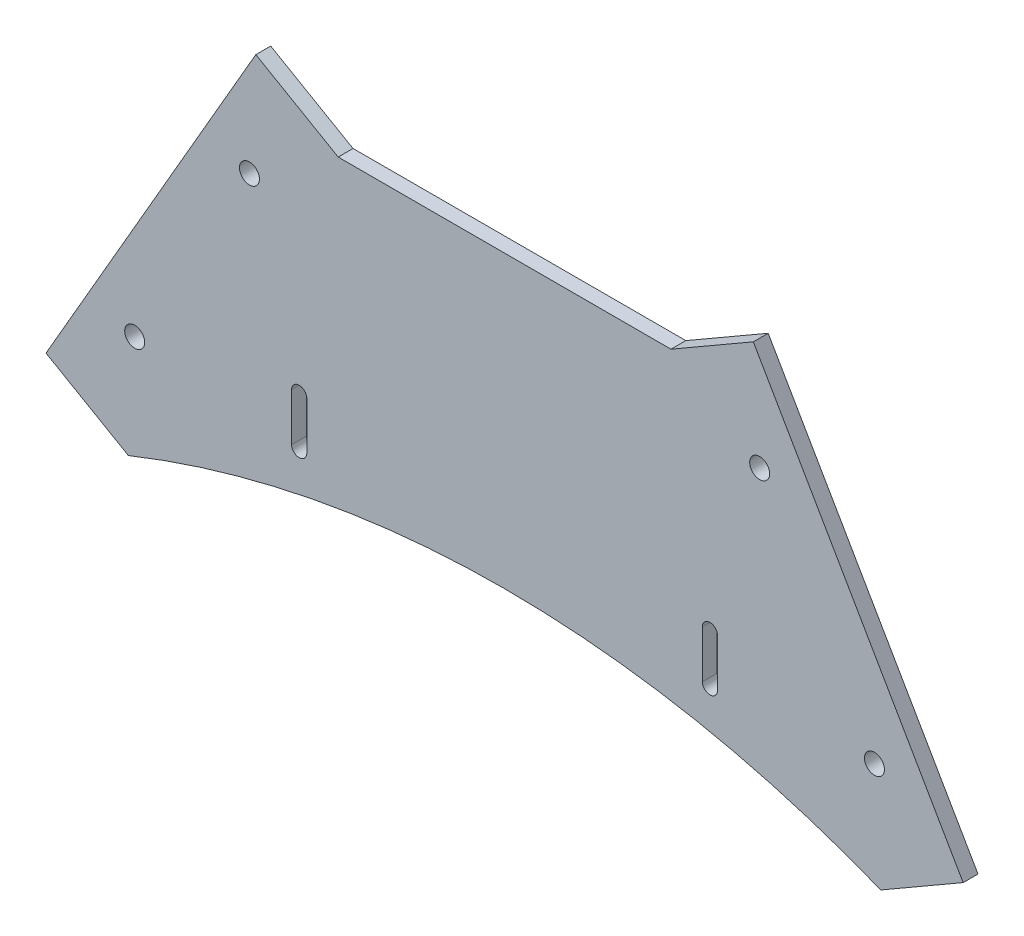
ISO-10303-21;
HEADER;
FILE_DESCRIPTION(('STEP AP214'),'2;1');
FILE_NAME('part.step','',(''),(''),'','','');
FILE_SCHEMA(('AUTOMOTIVE_DESIGN { 1 0 10303 214 1 1 1 1 }'));
ENDSEC;
DATA;
#1=APPLICATION_CONTEXT('core data for automotive mechanical design processes');
#2=APPLICATION_PROTOCOL_DEFINITION('international standard','automotive_design',2000,#1);
#3=PRODUCT_CONTEXT('',#1,'mechanical');
#4=PRODUCT('Part','Part','',(#3));
#5=PRODUCT_RELATED_PRODUCT_CATEGORY('part','',(#4));
#6=PRODUCT_DEFINITION_FORMATION('','',#4);
#7=PRODUCT_DEFINITION_CONTEXT('part definition',#1,'design');
#8=PRODUCT_DEFINITION('design','',#6,#7);
#9=PRODUCT_DEFINITION_SHAPE('','',#8);
#10=(LENGTH_UNIT() NAMED_UNIT(*) SI_UNIT(.MILLI.,.METRE.));
#11=(NAMED_UNIT(*) PLANE_ANGLE_UNIT() SI_UNIT($,.RADIAN.));
#12=(NAMED_UNIT(*) SI_UNIT($,.STERADIAN.) SOLID_ANGLE_UNIT());
#13=UNCERTAINTY_MEASURE_WITH_UNIT(LENGTH_MEASURE(1.E-05),#10,'distance_accuracy_value','');
#14=(GEOMETRIC_REPRESENTATION_CONTEXT(3) GLOBAL_UNCERTAINTY_ASSIGNED_CONTEXT((#13)) GLOBAL_UNIT_ASSIGNED_CONTEXT((#10,
#11,#12)) REPRESENTATION_CONTEXT('',''));
#15=CARTESIAN_POINT('',(0.,0.,0.));
#16=DIRECTION('',(0.,0.,1.));
#17=DIRECTION('',(1.,0.,0.));
#18=AXIS2_PLACEMENT_3D('',#15,#16,#17);
#19=CARTESIAN_POINT('',(96.4557505594944,-196.799575907765,3.125));
#20=DIRECTION('',(0.,0.,1.));
#21=DIRECTION('',(1.,0.,0.));
#22=AXIS2_PLACEMENT_3D('',#19,#20,#21);
#23=PLANE('',#22);
#24=CARTESIAN_POINT('',(150.116004597338,64.1239743106391,3.125));
#25=DIRECTION('',(0.,0.,1.));
#26=DIRECTION('',(1.,0.,0.));
#27=AXIS2_PLACEMENT_3D('',#24,#25,#26);
#28=CIRCLE('',#27,2.09999999999999);
#29=CARTESIAN_POINT('',(152.216004597338,64.1239743106391,3.125));
#30=VERTEX_POINT('',#29);
#31=EDGE_CURVE('E400',#30,#30,#28,.T.);
#32=ORIENTED_EDGE('',*,*,#31,.F.);
#33=EDGE_LOOP('',(#32));
#34=FACE_BOUND('',#33,.T.);
#35=CARTESIAN_POINT('',(42.7954965216511,64.1239743106392,3.125));
#36=DIRECTION('',(0.,0.,1.));
#37=DIRECTION('',(1.,0.,0.));
#38=AXIS2_PLACEMENT_3D('',#35,#36,#37);
#39=CIRCLE('',#38,2.10000000000002);
#40=CARTESIAN_POINT('',(44.8954965216512,64.1239743106392,3.125));
#41=VERTEX_POINT('',#40);
#42=EDGE_CURVE('E174',#41,#41,#39,.T.);
#43=ORIENTED_EDGE('',*,*,#42,.F.);
#44=EDGE_LOOP('',(#43));
#45=FACE_BOUND('',#44,.T.);
#46=CARTESIAN_POINT('',(96.4557505594944,-196.799575907765,3.125));
#47=DIRECTION('',(0.,0.,-1.));
#48=DIRECTION('',(1.,0.,0.));
#49=AXIS2_PLACEMENT_3D('',#46,#47,#48);
#50=CIRCLE('',#49,212.114260907765);
#51=CARTESIAN_POINT('',(17.3205080756887,1.6826817716975E-12,3.125));
#52=VERTEX_POINT('',#51);
#53=CARTESIAN_POINT('',(175.590993043302,1.9550500436325E-12,3.125));
#54=VERTEX_POINT('',#53);
#55=EDGE_CURVE('E215',#52,#54,#50,.T.);
#56=ORIENTED_EDGE('',*,*,#55,.T.);
#57=DIRECTION('',(0.866025403784439,0.499999999999999,0.));
#58=VECTOR('',#57,1.);
#59=CARTESIAN_POINT('',(175.590993043302,1.9550500436325E-12,3.125));
#60=LINE('',#59,#58);
#61=CARTESIAN_POINT('',(192.91150111899,10.0000000000016,3.125));
#62=VERTEX_POINT('',#61);
#63=EDGE_CURVE('E218',#54,#62,#60,.T.);
#64=ORIENTED_EDGE('',*,*,#63,.T.);
#65=DIRECTION('',(-0.499999999999998,0.86602540378444,0.));
#66=VECTOR('',#65,1.);
#67=CARTESIAN_POINT('',(148.776258635184,86.4444823863268,3.125));
#68=LINE('',#67,#66);
#69=CARTESIAN_POINT('',(148.776258635184,86.4444823863268,3.125));
#70=VERTEX_POINT('',#69);
#71=EDGE_CURVE('E221',#62,#70,#68,.T.);
#72=ORIENTED_EDGE('',*,*,#71,.T.);
#73=DIRECTION('',(-0.86602540378444,-0.499999999999997,0.));
#74=VECTOR('',#73,1.);
#75=CARTESIAN_POINT('',(131.455750559495,76.4444823863269,3.125));
#76=LINE('',#75,#74);
#77=CARTESIAN_POINT('',(131.455750559495,76.4444823863269,3.125));
#78=VERTEX_POINT('',#77);
#79=EDGE_CURVE('E223',#70,#78,#76,.T.);
#80=ORIENTED_EDGE('',*,*,#79,.T.);
#81=DIRECTION('',(-1.,0.,0.));
#82=VECTOR('',#81,1.);
#83=CARTESIAN_POINT('',(61.4557505594949,76.4444823863269,3.125));
#84=LINE('',#83,#82);
#85=CARTESIAN_POINT('',(61.4557505594949,76.4444823863269,3.125));
#86=VERTEX_POINT('',#85);
#87=EDGE_CURVE('E225',#78,#86,#84,.T.);
#88=ORIENTED_EDGE('',*,*,#87,.T.);
#89=DIRECTION('',(-0.86602540378444,0.499999999999998,0.));
#90=VECTOR('',#89,1.);
#91=CARTESIAN_POINT('',(61.4557505594949,76.4444823863269,3.125));
#92=LINE('',#91,#90);
#93=CARTESIAN_POINT('',(44.1352424838062,86.4444823863268,3.125));
#94=VERTEX_POINT('',#93);
#95=EDGE_CURVE('E227',#86,#94,#92,.T.);
#96=ORIENTED_EDGE('',*,*,#95,.T.);
#97=DIRECTION('',(-0.499999999999997,-0.86602540378444,0.));
#98=VECTOR('',#97,1.);
#99=CARTESIAN_POINT('',(44.1352424838062,86.4444823863268,3.125));
#100=LINE('',#99,#98);
#101=CARTESIAN_POINT('',(0.,10.0000000000016,3.125));
#102=VERTEX_POINT('',#101);
#103=EDGE_CURVE('E229',#94,#102,#100,.T.);
#104=ORIENTED_EDGE('',*,*,#103,.T.);
#105=DIRECTION('',(0.866025403784439,-0.499999999999999,0.));
#106=VECTOR('',#105,1.);
#107=CARTESIAN_POINT('',(17.3205080756887,1.6826817716975E-12,3.125));
#108=LINE('',#107,#106);
#109=EDGE_CURVE('E231',#102,#52,#108,.T.);
#110=ORIENTED_EDGE('',*,*,#109,.T.);
#111=EDGE_LOOP('',(#56,#64,#72,#80,#88,#96,#104,#110));
#112=FACE_BOUND('',#111,.T.);
#113=DIRECTION('',(0.,-1.,0.));
#114=VECTOR('',#113,1.);
#115=CARTESIAN_POINT('',(51.6557505594943,29.1748337660113,3.125));
#116=LINE('',#115,#114);
#117=CARTESIAN_POINT('',(51.6557505594943,29.1748337660113,3.125));
#118=VERTEX_POINT('',#117);
#119=CARTESIAN_POINT('',(51.6557505594943,19.1748337660114,3.125));
#120=VERTEX_POINT('',#119);
#121=EDGE_CURVE('E186',#118,#120,#116,.T.);
#122=ORIENTED_EDGE('',*,*,#121,.F.);
#123=CARTESIAN_POINT('',(53.2557505594943,29.1748337660113,3.125));
#124=DIRECTION('',(0.,0.,1.));
#125=DIRECTION('',(1.,0.,0.));
#126=AXIS2_PLACEMENT_3D('',#123,#124,#125);
#127=CIRCLE('',#126,1.59999999999999);
#128=CARTESIAN_POINT('',(54.8557505594943,29.1748337660113,3.125));
#129=VERTEX_POINT('',#128);
#130=EDGE_CURVE('E184',#129,#118,#127,.T.);
#131=ORIENTED_EDGE('',*,*,#130,.F.);
#132=DIRECTION('',(0.,1.,0.));
#133=VECTOR('',#132,1.);
#134=CARTESIAN_POINT('',(54.8557505594943,29.1748337660113,3.125));
#135=LINE('',#134,#133);
#136=CARTESIAN_POINT('',(54.8557505594943,19.1748337660114,3.125));
#137=VERTEX_POINT('',#136);
#138=EDGE_CURVE('E192',#137,#129,#135,.T.);
#139=ORIENTED_EDGE('',*,*,#138,.F.);
#140=CARTESIAN_POINT('',(53.2557505594943,19.1748337660114,3.125));
#141=DIRECTION('',(0.,0.,1.));
#142=DIRECTION('',(1.,0.,0.));
#143=AXIS2_PLACEMENT_3D('',#140,#141,#142);
#144=CIRCLE('',#143,1.59999999999999);
#145=EDGE_CURVE('E189',#120,#137,#144,.T.);
#146=ORIENTED_EDGE('',*,*,#145,.F.);
#147=EDGE_LOOP('',(#122,#131,#139,#146));
#148=FACE_BOUND('',#147,.T.);
#149=DIRECTION('',(0.,1.,0.));
#150=VECTOR('',#149,1.);
#151=CARTESIAN_POINT('',(141.255750559494,29.1748337660113,3.125));
#152=LINE('',#151,#150);
#153=CARTESIAN_POINT('',(141.255750559494,19.1748337660114,3.125));
#154=VERTEX_POINT('',#153);
#155=CARTESIAN_POINT('',(141.255750559494,29.1748337660113,3.125));
#156=VERTEX_POINT('',#155);
#157=EDGE_CURVE('E153',#154,#156,#152,.T.);
#158=ORIENTED_EDGE('',*,*,#157,.F.);
#159=CARTESIAN_POINT('',(139.655750559494,19.1748337660114,3.125));
#160=DIRECTION('',(0.,0.,1.));
#161=DIRECTION('',(1.,0.,0.));
#162=AXIS2_PLACEMENT_3D('',#159,#160,#161);
#163=CIRCLE('',#162,1.59999999999999);
#164=CARTESIAN_POINT('',(138.055750559494,19.1748337660114,3.125));
#165=VERTEX_POINT('',#164);
#166=EDGE_CURVE('E145',#165,#154,#163,.T.);
#167=ORIENTED_EDGE('',*,*,#166,.F.);
#168=DIRECTION('',(0.,-1.,0.));
#169=VECTOR('',#168,1.);
#170=CARTESIAN_POINT('',(138.055750559494,29.1748337660113,3.125));
#171=LINE('',#170,#169);
#172=CARTESIAN_POINT('',(138.055750559494,29.1748337660113,3.125));
#173=VERTEX_POINT('',#172);
#174=EDGE_CURVE('E168',#173,#165,#171,.T.);
#175=ORIENTED_EDGE('',*,*,#174,.F.);
#176=CARTESIAN_POINT('',(139.655750559494,29.1748337660113,3.125));
#177=DIRECTION('',(0.,0.,1.));
#178=DIRECTION('',(1.,0.,0.));
#179=AXIS2_PLACEMENT_3D('',#176,#177,#178);
#180=CIRCLE('',#179,1.59999999999999);
#181=EDGE_CURVE('E166',#156,#173,#180,.T.);
#182=ORIENTED_EDGE('',*,*,#181,.F.);
#183=EDGE_LOOP('',(#158,#167,#175,#182));
#184=FACE_BOUND('',#183,.T.);
#185=CARTESIAN_POINT('',(18.6602540378437,22.3205080756896,3.125));
#186=DIRECTION('',(0.,0.,1.));
#187=DIRECTION('',(1.,0.,0.));
#188=AXIS2_PLACEMENT_3D('',#185,#186,#187);
#189=CIRCLE('',#188,2.10000000000001);
#190=CARTESIAN_POINT('',(20.7602540378437,22.3205080756896,3.125));
#191=VERTEX_POINT('',#190);
#192=EDGE_CURVE('E406',#191,#191,#189,.T.);
#193=ORIENTED_EDGE('',*,*,#192,.F.);
#194=EDGE_LOOP('',(#193));
#195=FACE_BOUND('',#194,.T.);
#196=CARTESIAN_POINT('',(174.251247081145,22.3205080756895,3.125));
#197=DIRECTION('',(0.,0.,1.));
#198=DIRECTION('',(1.,0.,0.));
#199=AXIS2_PLACEMENT_3D('',#196,#197,#198);
#200=CIRCLE('',#199,2.09999999999999);
#201=CARTESIAN_POINT('',(176.351247081145,22.3205080756895,3.125));
#202=VERTEX_POINT('',#201);
#203=EDGE_CURVE('E391',#202,#202,#200,.T.);
#204=ORIENTED_EDGE('',*,*,#203,.F.);
#205=EDGE_LOOP('',(#204));
#206=FACE_BOUND('',#205,.T.);
#207=ADVANCED_FACE('F32',(#34,#45,#112,#148,#184,#195,#206),#23,.T.);
#208=CARTESIAN_POINT('',(96.4557505594944,-196.799575907765,0.));
#209=DIRECTION('',(0.,0.,1.));
#210=DIRECTION('',(1.,0.,0.));
#211=AXIS2_PLACEMENT_3D('',#208,#209,#210);
#212=PLANE('',#211);
#213=CARTESIAN_POINT('',(53.2557505594943,29.1748337660113,0.));
#214=DIRECTION('',(0.,0.,1.));
#215=DIRECTION('',(1.,0.,0.));
#216=AXIS2_PLACEMENT_3D('',#213,#214,#215);
#217=CIRCLE('',#216,1.59999999999999);
#218=CARTESIAN_POINT('',(54.8557505594943,29.1748337660113,0.));
#219=VERTEX_POINT('',#218);
#220=CARTESIAN_POINT('',(51.6557505594943,29.1748337660113,0.));
#221=VERTEX_POINT('',#220);
#222=EDGE_CURVE('E161',#219,#221,#217,.T.);
#223=ORIENTED_EDGE('',*,*,#222,.T.);
#224=DIRECTION('',(0.,-1.,0.));
#225=VECTOR('',#224,1.);
#226=CARTESIAN_POINT('',(51.6557505594943,29.1748337660113,0.));
#227=LINE('',#226,#225);
#228=CARTESIAN_POINT('',(51.6557505594943,19.1748337660114,0.));
#229=VERTEX_POINT('',#228);
#230=EDGE_CURVE('E197',#221,#229,#227,.T.);
#231=ORIENTED_EDGE('',*,*,#230,.T.);
#232=CARTESIAN_POINT('',(53.2557505594943,19.1748337660114,0.));
#233=DIRECTION('',(0.,0.,1.));
#234=DIRECTION('',(1.,0.,0.));
#235=AXIS2_PLACEMENT_3D('',#232,#233,#234);
#236=CIRCLE('',#235,1.59999999999999);
#237=CARTESIAN_POINT('',(54.8557505594943,19.1748337660114,0.));
#238=VERTEX_POINT('',#237);
#239=EDGE_CURVE('E200',#229,#238,#236,.T.);
#240=ORIENTED_EDGE('',*,*,#239,.T.);
#241=DIRECTION('',(0.,1.,0.));
#242=VECTOR('',#241,1.);
#243=CARTESIAN_POINT('',(54.8557505594943,29.1748337660113,0.));
#244=LINE('',#243,#242);
#245=EDGE_CURVE('E187',#238,#219,#244,.T.);
#246=ORIENTED_EDGE('',*,*,#245,.T.);
#247=EDGE_LOOP('',(#223,#231,#240,#246));
#248=FACE_BOUND('',#247,.T.);
#249=CARTESIAN_POINT('',(96.4557505594944,-196.799575907765,0.));
#250=DIRECTION('',(0.,0.,-1.));
#251=DIRECTION('',(1.,0.,0.));
#252=AXIS2_PLACEMENT_3D('',#249,#250,#251);
#253=CIRCLE('',#252,212.114260907765);
#254=CARTESIAN_POINT('',(17.3205080756887,1.6826817716975E-12,0.));
#255=VERTEX_POINT('',#254);
#256=CARTESIAN_POINT('',(175.590993043302,1.9550500436325E-12,0.));
#257=VERTEX_POINT('',#256);
#258=EDGE_CURVE('E214',#255,#257,#253,.T.);
#259=ORIENTED_EDGE('',*,*,#258,.F.);
#260=DIRECTION('',(0.866025403784439,-0.499999999999999,0.));
#261=VECTOR('',#260,1.);
#262=CARTESIAN_POINT('',(17.3205080756887,1.6826817716975E-12,0.));
#263=LINE('',#262,#261);
#264=CARTESIAN_POINT('',(0.,10.0000000000016,0.));
#265=VERTEX_POINT('',#264);
#266=EDGE_CURVE('E219',#265,#255,#263,.T.);
#267=ORIENTED_EDGE('',*,*,#266,.F.);
#268=DIRECTION('',(-0.499999999999997,-0.86602540378444,0.));
#269=VECTOR('',#268,1.);
#270=CARTESIAN_POINT('',(44.1352424838062,86.4444823863268,0.));
#271=LINE('',#270,#269);
#272=CARTESIAN_POINT('',(44.1352424838062,86.4444823863268,0.));
#273=VERTEX_POINT('',#272);
#274=EDGE_CURVE('E246',#273,#265,#271,.T.);
#275=ORIENTED_EDGE('',*,*,#274,.F.);
#276=DIRECTION('',(-0.86602540378444,0.499999999999998,0.));
#277=VECTOR('',#276,1.);
#278=CARTESIAN_POINT('',(61.4557505594949,76.4444823863269,0.));
#279=LINE('',#278,#277);
#280=CARTESIAN_POINT('',(61.4557505594949,76.4444823863269,0.));
#281=VERTEX_POINT('',#280);
#282=EDGE_CURVE('E244',#281,#273,#279,.T.);
#283=ORIENTED_EDGE('',*,*,#282,.F.);
#284=DIRECTION('',(-1.,0.,0.));
#285=VECTOR('',#284,1.);
#286=CARTESIAN_POINT('',(61.4557505594949,76.4444823863269,0.));
#287=LINE('',#286,#285);
#288=CARTESIAN_POINT('',(131.455750559495,76.4444823863269,0.));
#289=VERTEX_POINT('',#288);
#290=EDGE_CURVE('E242',#289,#281,#287,.T.);
#291=ORIENTED_EDGE('',*,*,#290,.F.);
#292=DIRECTION('',(-0.86602540378444,-0.499999999999997,0.));
#293=VECTOR('',#292,1.);
#294=CARTESIAN_POINT('',(131.455750559495,76.4444823863269,0.));
#295=LINE('',#294,#293);
#296=CARTESIAN_POINT('',(148.776258635184,86.4444823863268,0.));
#297=VERTEX_POINT('',#296);
#298=EDGE_CURVE('E240',#297,#289,#295,.T.);
#299=ORIENTED_EDGE('',*,*,#298,.F.);
#300=DIRECTION('',(-0.499999999999998,0.86602540378444,0.));
#301=VECTOR('',#300,1.);
#302=CARTESIAN_POINT('',(148.776258635184,86.4444823863268,0.));
#303=LINE('',#302,#301);
#304=CARTESIAN_POINT('',(192.91150111899,10.0000000000016,0.));
#305=VERTEX_POINT('',#304);
#306=EDGE_CURVE('E238',#305,#297,#303,.T.);
#307=ORIENTED_EDGE('',*,*,#306,.F.);
#308=DIRECTION('',(0.866025403784439,0.499999999999999,0.));
#309=VECTOR('',#308,1.);
#310=CARTESIAN_POINT('',(175.590993043302,1.9550500436325E-12,0.));
#311=LINE('',#310,#309);
#312=EDGE_CURVE('E236',#257,#305,#311,.T.);
#313=ORIENTED_EDGE('',*,*,#312,.F.);
#314=EDGE_LOOP('',(#259,#267,#275,#283,#291,#299,#307,#313));
#315=FACE_BOUND('',#314,.T.);
#316=CARTESIAN_POINT('',(139.655750559494,19.1748337660114,0.));
#317=DIRECTION('',(0.,0.,1.));
#318=DIRECTION('',(1.,0.,0.));
#319=AXIS2_PLACEMENT_3D('',#316,#317,#318);
#320=CIRCLE('',#319,1.59999999999999);
#321=CARTESIAN_POINT('',(138.055750559494,19.1748337660114,0.));
#322=VERTEX_POINT('',#321);
#323=CARTESIAN_POINT('',(141.255750559494,19.1748337660114,0.));
#324=VERTEX_POINT('',#323);
#325=EDGE_CURVE('E55',#322,#324,#320,.T.);
#326=ORIENTED_EDGE('',*,*,#325,.T.);
#327=DIRECTION('',(0.,1.,0.));
#328=VECTOR('',#327,1.);
#329=CARTESIAN_POINT('',(141.255750559494,29.1748337660113,0.));
#330=LINE('',#329,#328);
#331=CARTESIAN_POINT('',(141.255750559494,29.1748337660113,0.));
#332=VERTEX_POINT('',#331);
#333=EDGE_CURVE('E160',#324,#332,#330,.T.);
#334=ORIENTED_EDGE('',*,*,#333,.T.);
#335=CARTESIAN_POINT('',(139.655750559494,29.1748337660113,0.));
#336=DIRECTION('',(0.,0.,1.));
#337=DIRECTION('',(1.,0.,0.));
#338=AXIS2_PLACEMENT_3D('',#335,#336,#337);
#339=CIRCLE('',#338,1.59999999999999);
#340=CARTESIAN_POINT('',(138.055750559494,29.1748337660113,0.));
#341=VERTEX_POINT('',#340);
#342=EDGE_CURVE('E176',#332,#341,#339,.T.);
#343=ORIENTED_EDGE('',*,*,#342,.T.);
#344=DIRECTION('',(0.,-1.,0.));
#345=VECTOR('',#344,1.);
#346=CARTESIAN_POINT('',(138.055750559494,29.1748337660113,0.));
#347=LINE('',#346,#345);
#348=EDGE_CURVE('E154',#341,#322,#347,.T.);
#349=ORIENTED_EDGE('',*,*,#348,.T.);
#350=EDGE_LOOP('',(#326,#334,#343,#349));
#351=FACE_BOUND('',#350,.T.);
#352=CARTESIAN_POINT('',(42.7954965216511,64.1239743106392,0.));
#353=DIRECTION('',(0.,0.,1.));
#354=DIRECTION('',(1.,0.,0.));
#355=AXIS2_PLACEMENT_3D('',#352,#353,#354);
#356=CIRCLE('',#355,2.10000000000002);
#357=CARTESIAN_POINT('',(44.8954965216512,64.1239743106392,0.));
#358=VERTEX_POINT('',#357);
#359=EDGE_CURVE('E409',#358,#358,#356,.T.);
#360=ORIENTED_EDGE('',*,*,#359,.T.);
#361=EDGE_LOOP('',(#360));
#362=FACE_BOUND('',#361,.T.);
#363=CARTESIAN_POINT('',(18.6602540378437,22.3205080756896,0.));
#364=DIRECTION('',(0.,0.,1.));
#365=DIRECTION('',(1.,0.,0.));
#366=AXIS2_PLACEMENT_3D('',#363,#364,#365);
#367=CIRCLE('',#366,2.10000000000001);
#368=CARTESIAN_POINT('',(20.7602540378437,22.3205080756896,0.));
#369=VERTEX_POINT('',#368);
#370=EDGE_CURVE('E403',#369,#369,#367,.T.);
#371=ORIENTED_EDGE('',*,*,#370,.T.);
#372=EDGE_LOOP('',(#371));
#373=FACE_BOUND('',#372,.T.);
#374=CARTESIAN_POINT('',(150.116004597338,64.1239743106391,0.));
#375=DIRECTION('',(0.,0.,1.));
#376=DIRECTION('',(1.,0.,0.));
#377=AXIS2_PLACEMENT_3D('',#374,#375,#376);
#378=CIRCLE('',#377,2.09999999999999);
#379=CARTESIAN_POINT('',(152.216004597338,64.1239743106391,0.));
#380=VERTEX_POINT('',#379);
#381=EDGE_CURVE('E397',#380,#380,#378,.T.);
#382=ORIENTED_EDGE('',*,*,#381,.T.);
#383=EDGE_LOOP('',(#382));
#384=FACE_BOUND('',#383,.T.);
#385=CARTESIAN_POINT('',(174.251247081145,22.3205080756895,0.));
#386=DIRECTION('',(0.,0.,1.));
#387=DIRECTION('',(1.,0.,0.));
#388=AXIS2_PLACEMENT_3D('',#385,#386,#387);
#389=CIRCLE('',#388,2.09999999999999);
#390=CARTESIAN_POINT('',(176.351247081145,22.3205080756895,0.));
#391=VERTEX_POINT('',#390);
#392=EDGE_CURVE('E394',#391,#391,#389,.T.);
#393=ORIENTED_EDGE('',*,*,#392,.T.);
#394=EDGE_LOOP('',(#393));
#395=FACE_BOUND('',#394,.T.);
#396=ADVANCED_FACE('F276',(#248,#315,#351,#362,#373,#384,#395),#212,.F.);
#397=CARTESIAN_POINT('',(96.4557505594944,-196.799575907765,3.125));
#398=DIRECTION('',(0.,0.,-1.));
#399=DIRECTION('',(-1.,0.,0.));
#400=AXIS2_PLACEMENT_3D('',#397,#398,#399);
#401=CYLINDRICAL_SURFACE('',#400,212.114260907765);
#402=ORIENTED_EDGE('',*,*,#258,.T.);
#403=DIRECTION('',(0.,0.,-1.));
#404=VECTOR('',#403,1.);
#405=CARTESIAN_POINT('',(175.590993043302,1.9550500436325E-12,3.125));
#406=LINE('',#405,#404);
#407=EDGE_CURVE('E11',#54,#257,#406,.T.);
#408=ORIENTED_EDGE('',*,*,#407,.F.);
#409=ORIENTED_EDGE('',*,*,#55,.F.);
#410=DIRECTION('',(0.,0.,-1.));
#411=VECTOR('',#410,1.);
#412=CARTESIAN_POINT('',(17.3205080756887,1.6826817716975E-12,3.125));
#413=LINE('',#412,#411);
#414=EDGE_CURVE('E233',#52,#255,#413,.T.);
#415=ORIENTED_EDGE('',*,*,#414,.T.);
#416=EDGE_LOOP('',(#402,#408,#409,#415));
#417=FACE_BOUND('',#416,.T.);
#418=ADVANCED_FACE('F34',(#417),#401,.F.);
#419=CARTESIAN_POINT('',(175.590993043302,1.9550500436325E-12,3.125));
#420=DIRECTION('',(-0.499999999999999,0.866025403784439,0.));
#421=DIRECTION('',(-0.866025403784439,-0.499999999999999,0.));
#422=AXIS2_PLACEMENT_3D('',#419,#420,#421);
#423=PLANE('',#422);
#424=ORIENTED_EDGE('',*,*,#312,.T.);
#425=DIRECTION('',(0.,0.,-1.));
#426=VECTOR('',#425,1.);
#427=CARTESIAN_POINT('',(192.91150111899,10.0000000000016,3.125));
#428=LINE('',#427,#426);
#429=EDGE_CURVE('E40',#62,#305,#428,.T.);
#430=ORIENTED_EDGE('',*,*,#429,.F.);
#431=ORIENTED_EDGE('',*,*,#63,.F.);
#432=ORIENTED_EDGE('',*,*,#407,.T.);
#433=EDGE_LOOP('',(#424,#430,#431,#432));
#434=FACE_BOUND('',#433,.T.);
#435=ADVANCED_FACE('F294',(#434),#423,.F.);
#436=CARTESIAN_POINT('',(148.776258635184,86.4444823863268,3.125));
#437=DIRECTION('',(-0.86602540378444,-0.499999999999998,0.));
#438=DIRECTION('',(0.499999999999998,-0.86602540378444,0.));
#439=AXIS2_PLACEMENT_3D('',#436,#437,#438);
#440=PLANE('',#439);
#441=ORIENTED_EDGE('',*,*,#306,.T.);
#442=DIRECTION('',(0.,0.,-1.));
#443=VECTOR('',#442,1.);
#444=CARTESIAN_POINT('',(148.776258635184,86.4444823863268,3.125));
#445=LINE('',#444,#443);
#446=EDGE_CURVE('E263',#70,#297,#445,.T.);
#447=ORIENTED_EDGE('',*,*,#446,.F.);
#448=ORIENTED_EDGE('',*,*,#71,.F.);
#449=ORIENTED_EDGE('',*,*,#429,.T.);
#450=EDGE_LOOP('',(#441,#447,#448,#449));
#451=FACE_BOUND('',#450,.T.);
#452=ADVANCED_FACE('F270',(#451),#440,.F.);
#453=CARTESIAN_POINT('',(131.455750559495,76.4444823863269,3.125));
#454=DIRECTION('',(0.499999999999997,-0.86602540378444,0.));
#455=DIRECTION('',(0.86602540378444,0.499999999999997,0.));
#456=AXIS2_PLACEMENT_3D('',#453,#454,#455);
#457=PLANE('',#456);
#458=ORIENTED_EDGE('',*,*,#298,.T.);
#459=DIRECTION('',(0.,0.,-1.));
#460=VECTOR('',#459,1.);
#461=CARTESIAN_POINT('',(131.455750559495,76.4444823863269,3.125));
#462=LINE('',#461,#460);
#463=EDGE_CURVE('E260',#78,#289,#462,.T.);
#464=ORIENTED_EDGE('',*,*,#463,.F.);
#465=ORIENTED_EDGE('',*,*,#79,.F.);
#466=ORIENTED_EDGE('',*,*,#446,.T.);
#467=EDGE_LOOP('',(#458,#464,#465,#466));
#468=FACE_BOUND('',#467,.T.);
#469=ADVANCED_FACE('F282',(#468),#457,.F.);
#470=CARTESIAN_POINT('',(61.4557505594949,76.4444823863269,3.125));
#471=DIRECTION('',(0.,-1.,0.));
#472=DIRECTION('',(1.,0.,0.));
#473=AXIS2_PLACEMENT_3D('',#470,#471,#472);
#474=PLANE('',#473);
#475=ORIENTED_EDGE('',*,*,#290,.T.);
#476=DIRECTION('',(0.,0.,-1.));
#477=VECTOR('',#476,1.);
#478=CARTESIAN_POINT('',(61.4557505594949,76.4444823863269,3.125));
#479=LINE('',#478,#477);
#480=EDGE_CURVE('E257',#86,#281,#479,.T.);
#481=ORIENTED_EDGE('',*,*,#480,.F.);
#482=ORIENTED_EDGE('',*,*,#87,.F.);
#483=ORIENTED_EDGE('',*,*,#463,.T.);
#484=EDGE_LOOP('',(#475,#481,#482,#483));
#485=FACE_BOUND('',#484,.T.);
#486=ADVANCED_FACE('F286',(#485),#474,.F.);
#487=CARTESIAN_POINT('',(61.4557505594949,76.4444823863269,3.125));
#488=DIRECTION('',(-0.499999999999998,-0.86602540378444,0.));
#489=DIRECTION('',(0.86602540378444,-0.499999999999998,0.));
#490=AXIS2_PLACEMENT_3D('',#487,#488,#489);
#491=PLANE('',#490);
#492=ORIENTED_EDGE('',*,*,#282,.T.);
#493=DIRECTION('',(0.,0.,-1.));
#494=VECTOR('',#493,1.);
#495=CARTESIAN_POINT('',(44.1352424838062,86.4444823863268,3.125));
#496=LINE('',#495,#494);
#497=EDGE_CURVE('E254',#94,#273,#496,.T.);
#498=ORIENTED_EDGE('',*,*,#497,.F.);
#499=ORIENTED_EDGE('',*,*,#95,.F.);
#500=ORIENTED_EDGE('',*,*,#480,.T.);
#501=EDGE_LOOP('',(#492,#498,#499,#500));
#502=FACE_BOUND('',#501,.T.);
#503=ADVANCED_FACE('F307',(#502),#491,.F.);
#504=CARTESIAN_POINT('',(44.1352424838062,86.4444823863268,3.125));
#505=DIRECTION('',(0.86602540378444,-0.499999999999997,0.));
#506=DIRECTION('',(0.499999999999997,0.86602540378444,0.));
#507=AXIS2_PLACEMENT_3D('',#504,#505,#506);
#508=PLANE('',#507);
#509=ORIENTED_EDGE('',*,*,#274,.T.);
#510=DIRECTION('',(0.,0.,-1.));
#511=VECTOR('',#510,1.);
#512=CARTESIAN_POINT('',(0.,10.0000000000016,3.125));
#513=LINE('',#512,#511);
#514=EDGE_CURVE('E251',#102,#265,#513,.T.);
#515=ORIENTED_EDGE('',*,*,#514,.F.);
#516=ORIENTED_EDGE('',*,*,#103,.F.);
#517=ORIENTED_EDGE('',*,*,#497,.T.);
#518=EDGE_LOOP('',(#509,#515,#516,#517));
#519=FACE_BOUND('',#518,.T.);
#520=ADVANCED_FACE('F305',(#519),#508,.F.);
#521=CARTESIAN_POINT('',(17.3205080756887,1.6826817716975E-12,3.125));
#522=DIRECTION('',(0.499999999999999,0.866025403784439,0.));
#523=DIRECTION('',(-0.866025403784439,0.499999999999999,0.));
#524=AXIS2_PLACEMENT_3D('',#521,#522,#523);
#525=PLANE('',#524);
#526=ORIENTED_EDGE('',*,*,#266,.T.);
#527=ORIENTED_EDGE('',*,*,#414,.F.);
#528=ORIENTED_EDGE('',*,*,#109,.F.);
#529=ORIENTED_EDGE('',*,*,#514,.T.);
#530=EDGE_LOOP('',(#526,#527,#528,#529));
#531=FACE_BOUND('',#530,.T.);
#532=ADVANCED_FACE('F300',(#531),#525,.F.);
#533=CARTESIAN_POINT('',(53.2557505594943,29.1748337660113,3.125));
#534=DIRECTION('',(0.,0.,-1.));
#535=DIRECTION('',(-1.,0.,0.));
#536=AXIS2_PLACEMENT_3D('',#533,#534,#535);
#537=CYLINDRICAL_SURFACE('',#536,1.59999999999999);
#538=ORIENTED_EDGE('',*,*,#222,.F.);
#539=DIRECTION('',(0.,0.,-1.));
#540=VECTOR('',#539,1.);
#541=CARTESIAN_POINT('',(54.8557505594943,29.1748337660113,3.125));
#542=LINE('',#541,#540);
#543=EDGE_CURVE('E194',#129,#219,#542,.T.);
#544=ORIENTED_EDGE('',*,*,#543,.F.);
#545=ORIENTED_EDGE('',*,*,#130,.T.);
#546=DIRECTION('',(0.,0.,-1.));
#547=VECTOR('',#546,1.);
#548=CARTESIAN_POINT('',(51.6557505594943,29.1748337660113,3.125));
#549=LINE('',#548,#547);
#550=EDGE_CURVE('E211',#118,#221,#549,.T.);
#551=ORIENTED_EDGE('',*,*,#550,.T.);
#552=EDGE_LOOP('',(#538,#544,#545,#551));
#553=FACE_BOUND('',#552,.T.);
#554=ADVANCED_FACE('F327',(#553),#537,.F.);
#555=CARTESIAN_POINT('',(51.6557505594943,29.1748337660113,3.125));
#556=DIRECTION('',(1.,0.,0.));
#557=DIRECTION('',(0.,0.,-1.));
#558=AXIS2_PLACEMENT_3D('',#555,#556,#557);
#559=PLANE('',#558);
#560=ORIENTED_EDGE('',*,*,#230,.F.);
#561=ORIENTED_EDGE('',*,*,#550,.F.);
#562=ORIENTED_EDGE('',*,*,#121,.T.);
#563=DIRECTION('',(0.,0.,-1.));
#564=VECTOR('',#563,1.);
#565=CARTESIAN_POINT('',(51.6557505594943,19.1748337660114,3.125));
#566=LINE('',#565,#564);
#567=EDGE_CURVE('E209',#120,#229,#566,.T.);
#568=ORIENTED_EDGE('',*,*,#567,.T.);
#569=EDGE_LOOP('',(#560,#561,#562,#568));
#570=FACE_BOUND('',#569,.T.);
#571=ADVANCED_FACE('F334',(#570),#559,.T.);
#572=CARTESIAN_POINT('',(53.2557505594943,19.1748337660114,3.125));
#573=DIRECTION('',(0.,0.,-1.));
#574=DIRECTION('',(-1.,0.,0.));
#575=AXIS2_PLACEMENT_3D('',#572,#573,#574);
#576=CYLINDRICAL_SURFACE('',#575,1.59999999999999);
#577=ORIENTED_EDGE('',*,*,#239,.F.);
#578=ORIENTED_EDGE('',*,*,#567,.F.);
#579=ORIENTED_EDGE('',*,*,#145,.T.);
#580=DIRECTION('',(0.,0.,-1.));
#581=VECTOR('',#580,1.);
#582=CARTESIAN_POINT('',(54.8557505594943,19.1748337660114,3.125));
#583=LINE('',#582,#581);
#584=EDGE_CURVE('E207',#137,#238,#583,.T.);
#585=ORIENTED_EDGE('',*,*,#584,.T.);
#586=EDGE_LOOP('',(#577,#578,#579,#585));
#587=FACE_BOUND('',#586,.T.);
#588=ADVANCED_FACE('F339',(#587),#576,.F.);
#589=CARTESIAN_POINT('',(54.8557505594943,29.1748337660113,3.125));
#590=DIRECTION('',(-1.,0.,0.));
#591=DIRECTION('',(0.,0.,1.));
#592=AXIS2_PLACEMENT_3D('',#589,#590,#591);
#593=PLANE('',#592);
#594=ORIENTED_EDGE('',*,*,#245,.F.);
#595=ORIENTED_EDGE('',*,*,#584,.F.);
#596=ORIENTED_EDGE('',*,*,#138,.T.);
#597=ORIENTED_EDGE('',*,*,#543,.T.);
#598=EDGE_LOOP('',(#594,#595,#596,#597));
#599=FACE_BOUND('',#598,.T.);
#600=ADVANCED_FACE('F346',(#599),#593,.T.);
#601=CARTESIAN_POINT('',(139.655750559494,19.1748337660114,3.125));
#602=DIRECTION('',(0.,0.,-1.));
#603=DIRECTION('',(-1.,0.,0.));
#604=AXIS2_PLACEMENT_3D('',#601,#602,#603);
#605=CYLINDRICAL_SURFACE('',#604,1.59999999999999);
#606=ORIENTED_EDGE('',*,*,#325,.F.);
#607=DIRECTION('',(0.,0.,-1.));
#608=VECTOR('',#607,1.);
#609=CARTESIAN_POINT('',(138.055750559494,19.1748337660114,3.125));
#610=LINE('',#609,#608);
#611=EDGE_CURVE('E149',#165,#322,#610,.T.);
#612=ORIENTED_EDGE('',*,*,#611,.F.);
#613=ORIENTED_EDGE('',*,*,#166,.T.);
#614=DIRECTION('',(0.,0.,-1.));
#615=VECTOR('',#614,1.);
#616=CARTESIAN_POINT('',(141.255750559494,19.1748337660114,3.125));
#617=LINE('',#616,#615);
#618=EDGE_CURVE('E148',#154,#324,#617,.T.);
#619=ORIENTED_EDGE('',*,*,#618,.T.);
#620=EDGE_LOOP('',(#606,#612,#613,#619));
#621=FACE_BOUND('',#620,.T.);
#622=ADVANCED_FACE('F147',(#621),#605,.F.);
#623=CARTESIAN_POINT('',(141.255750559494,29.1748337660113,3.125));
#624=DIRECTION('',(-1.,0.,0.));
#625=DIRECTION('',(0.,0.,1.));
#626=AXIS2_PLACEMENT_3D('',#623,#624,#625);
#627=PLANE('',#626);
#628=ORIENTED_EDGE('',*,*,#333,.F.);
#629=ORIENTED_EDGE('',*,*,#618,.F.);
#630=ORIENTED_EDGE('',*,*,#157,.T.);
#631=DIRECTION('',(0.,0.,-1.));
#632=VECTOR('',#631,1.);
#633=CARTESIAN_POINT('',(141.255750559494,29.1748337660113,3.125));
#634=LINE('',#633,#632);
#635=EDGE_CURVE('E162',#156,#332,#634,.T.);
#636=ORIENTED_EDGE('',*,*,#635,.T.);
#637=EDGE_LOOP('',(#628,#629,#630,#636));
#638=FACE_BOUND('',#637,.T.);
#639=ADVANCED_FACE('F157',(#638),#627,.T.);
#640=CARTESIAN_POINT('',(139.655750559494,29.1748337660113,3.125));
#641=DIRECTION('',(0.,0.,-1.));
#642=DIRECTION('',(-1.,0.,0.));
#643=AXIS2_PLACEMENT_3D('',#640,#641,#642);
#644=CYLINDRICAL_SURFACE('',#643,1.59999999999999);
#645=ORIENTED_EDGE('',*,*,#342,.F.);
#646=ORIENTED_EDGE('',*,*,#635,.F.);
#647=ORIENTED_EDGE('',*,*,#181,.T.);
#648=DIRECTION('',(0.,0.,-1.));
#649=VECTOR('',#648,1.);
#650=CARTESIAN_POINT('',(138.055750559494,29.1748337660113,3.125));
#651=LINE('',#650,#649);
#652=EDGE_CURVE('E47',#173,#341,#651,.T.);
#653=ORIENTED_EDGE('',*,*,#652,.T.);
#654=EDGE_LOOP('',(#645,#646,#647,#653));
#655=FACE_BOUND('',#654,.T.);
#656=ADVANCED_FACE('F364',(#655),#644,.F.);
#657=CARTESIAN_POINT('',(138.055750559494,29.1748337660113,3.125));
#658=DIRECTION('',(1.,0.,0.));
#659=DIRECTION('',(0.,0.,-1.));
#660=AXIS2_PLACEMENT_3D('',#657,#658,#659);
#661=PLANE('',#660);
#662=ORIENTED_EDGE('',*,*,#348,.F.);
#663=ORIENTED_EDGE('',*,*,#652,.F.);
#664=ORIENTED_EDGE('',*,*,#174,.T.);
#665=ORIENTED_EDGE('',*,*,#611,.T.);
#666=EDGE_LOOP('',(#662,#663,#664,#665));
#667=FACE_BOUND('',#666,.T.);
#668=ADVANCED_FACE('F367',(#667),#661,.T.);
#669=CARTESIAN_POINT('',(42.7954965216511,64.1239743106392,3.125));
#670=DIRECTION('',(0.,0.,-1.));
#671=DIRECTION('',(-1.,0.,0.));
#672=AXIS2_PLACEMENT_3D('',#669,#670,#671);
#673=CYLINDRICAL_SURFACE('',#672,2.10000000000002);
#674=ORIENTED_EDGE('',*,*,#42,.T.);
#675=EDGE_LOOP('',(#674));
#676=FACE_BOUND('',#675,.T.);
#677=ORIENTED_EDGE('',*,*,#359,.F.);
#678=EDGE_LOOP('',(#677));
#679=FACE_BOUND('',#678,.T.);
#680=ADVANCED_FACE('F371',(#676,#679),#673,.F.);
#681=CARTESIAN_POINT('',(18.6602540378437,22.3205080756896,3.125));
#682=DIRECTION('',(0.,0.,-1.));
#683=DIRECTION('',(-1.,0.,0.));
#684=AXIS2_PLACEMENT_3D('',#681,#682,#683);
#685=CYLINDRICAL_SURFACE('',#684,2.10000000000001);
#686=ORIENTED_EDGE('',*,*,#192,.T.);
#687=EDGE_LOOP('',(#686));
#688=FACE_BOUND('',#687,.T.);
#689=ORIENTED_EDGE('',*,*,#370,.F.);
#690=EDGE_LOOP('',(#689));
#691=FACE_BOUND('',#690,.T.);
#692=ADVANCED_FACE('F374',(#688,#691),#685,.F.);
#693=CARTESIAN_POINT('',(150.116004597338,64.1239743106391,3.125));
#694=DIRECTION('',(0.,0.,-1.));
#695=DIRECTION('',(-1.,0.,0.));
#696=AXIS2_PLACEMENT_3D('',#693,#694,#695);
#697=CYLINDRICAL_SURFACE('',#696,2.09999999999999);
#698=ORIENTED_EDGE('',*,*,#31,.T.);
#699=EDGE_LOOP('',(#698));
#700=FACE_BOUND('',#699,.T.);
#701=ORIENTED_EDGE('',*,*,#381,.F.);
#702=EDGE_LOOP('',(#701));
#703=FACE_BOUND('',#702,.T.);
#704=ADVANCED_FACE('F378',(#700,#703),#697,.F.);
#705=CARTESIAN_POINT('',(174.251247081145,22.3205080756895,3.125));
#706=DIRECTION('',(0.,0.,-1.));
#707=DIRECTION('',(-1.,0.,0.));
#708=AXIS2_PLACEMENT_3D('',#705,#706,#707);
#709=CYLINDRICAL_SURFACE('',#708,2.09999999999999);
#710=ORIENTED_EDGE('',*,*,#203,.T.);
#711=EDGE_LOOP('',(#710));
#712=FACE_BOUND('',#711,.T.);
#713=ORIENTED_EDGE('',*,*,#392,.F.);
#714=EDGE_LOOP('',(#713));
#715=FACE_BOUND('',#714,.T.);
#716=ADVANCED_FACE('F382',(#712,#715),#709,.F.);
#717=CLOSED_SHELL('',(#207,#396,#418,#435,#452,#469,#486,#503,#520,#532,#554,#571,#588,#600,
#622,#639,#656,#668,#680,#692,#704,#716));
#718=MANIFOLD_SOLID_BREP('B2',#717);
#719=ADVANCED_BREP_SHAPE_REPRESENTATION('',(#18,#718),#14);
#720=SHAPE_DEFINITION_REPRESENTATION(#9,#719);
ENDSEC;
END-ISO-10303-21;
